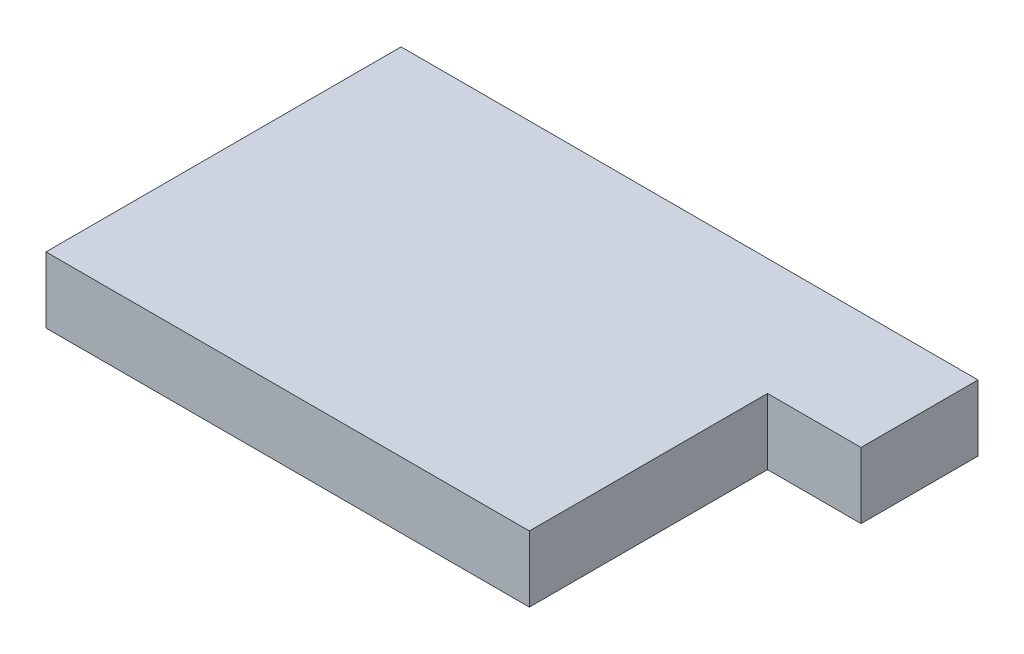
ISO-10303-21;
HEADER;
FILE_DESCRIPTION(('STEP AP214'),'2;1');
FILE_NAME('part.step','',(''),(''),'','','');
FILE_SCHEMA(('AUTOMOTIVE_DESIGN { 1 0 10303 214 1 1 1 1 }'));
ENDSEC;
DATA;
#1=APPLICATION_CONTEXT('core data for automotive mechanical design processes');
#2=APPLICATION_PROTOCOL_DEFINITION('international standard','automotive_design',2000,#1);
#3=PRODUCT_CONTEXT('',#1,'mechanical');
#4=PRODUCT('Part','Part','',(#3));
#5=PRODUCT_RELATED_PRODUCT_CATEGORY('part','',(#4));
#6=PRODUCT_DEFINITION_FORMATION('','',#4);
#7=PRODUCT_DEFINITION_CONTEXT('part definition',#1,'design');
#8=PRODUCT_DEFINITION('design','',#6,#7);
#9=PRODUCT_DEFINITION_SHAPE('','',#8);
#10=(LENGTH_UNIT() NAMED_UNIT(*) SI_UNIT(.MILLI.,.METRE.));
#11=(NAMED_UNIT(*) PLANE_ANGLE_UNIT() SI_UNIT($,.RADIAN.));
#12=(NAMED_UNIT(*) SI_UNIT($,.STERADIAN.) SOLID_ANGLE_UNIT());
#13=UNCERTAINTY_MEASURE_WITH_UNIT(LENGTH_MEASURE(1.E-05),#10,'distance_accuracy_value','');
#14=(GEOMETRIC_REPRESENTATION_CONTEXT(3) GLOBAL_UNCERTAINTY_ASSIGNED_CONTEXT((#13)) GLOBAL_UNIT_ASSIGNED_CONTEXT((#10,
#11,#12)) REPRESENTATION_CONTEXT('',''));
#15=CARTESIAN_POINT('',(0.,0.,0.));
#16=DIRECTION('',(0.,0.,1.));
#17=DIRECTION('',(1.,0.,0.));
#18=AXIS2_PLACEMENT_3D('',#15,#16,#17);
#19=CARTESIAN_POINT('',(139.55,38.1,-34.985));
#20=DIRECTION('',(-1.,0.,0.));
#21=DIRECTION('',(0.,0.,1.));
#22=AXIS2_PLACEMENT_3D('',#19,#20,#21);
#23=PLANE('',#22);
#24=DIRECTION('',(0.,0.,-1.));
#25=VECTOR('',#24,1.);
#26=CARTESIAN_POINT('',(139.55,0.,-34.985));
#27=LINE('',#26,#25);
#28=CARTESIAN_POINT('',(139.55,0.,102.515));
#29=VERTEX_POINT('',#28);
#30=CARTESIAN_POINT('',(139.55,0.,-34.985));
#31=VERTEX_POINT('',#30);
#32=EDGE_CURVE('E116',#29,#31,#27,.T.);
#33=ORIENTED_EDGE('',*,*,#32,.T.);
#34=DIRECTION('',(0.,-1.,0.));
#35=VECTOR('',#34,1.);
#36=CARTESIAN_POINT('',(139.55,38.1,-34.985));
#37=LINE('',#36,#35);
#38=CARTESIAN_POINT('',(139.55,38.1,-34.985));
#39=VERTEX_POINT('',#38);
#40=EDGE_CURVE('E11',#39,#31,#37,.T.);
#41=ORIENTED_EDGE('',*,*,#40,.F.);
#42=DIRECTION('',(0.,0.,-1.));
#43=VECTOR('',#42,1.);
#44=CARTESIAN_POINT('',(139.55,38.1,-34.985));
#45=LINE('',#44,#43);
#46=CARTESIAN_POINT('',(139.55,38.1,102.515));
#47=VERTEX_POINT('',#46);
#48=EDGE_CURVE('E127',#47,#39,#45,.T.);
#49=ORIENTED_EDGE('',*,*,#48,.F.);
#50=DIRECTION('',(0.,-1.,0.));
#51=VECTOR('',#50,1.);
#52=CARTESIAN_POINT('',(139.55,38.1,102.515));
#53=LINE('',#52,#51);
#54=EDGE_CURVE('E112',#47,#29,#53,.T.);
#55=ORIENTED_EDGE('',*,*,#54,.T.);
#56=EDGE_LOOP('',(#33,#41,#49,#55));
#57=FACE_BOUND('',#56,.T.);
#58=ADVANCED_FACE('F33',(#57),#23,.F.);
#59=CARTESIAN_POINT('',(139.55,38.1,-34.985));
#60=DIRECTION('',(0.,0.,-1.));
#61=DIRECTION('',(-1.,0.,0.));
#62=AXIS2_PLACEMENT_3D('',#59,#60,#61);
#63=PLANE('',#62);
#64=DIRECTION('',(1.,0.,0.));
#65=VECTOR('',#64,1.);
#66=CARTESIAN_POINT('',(139.55,0.,-34.985));
#67=LINE('',#66,#65);
#68=CARTESIAN_POINT('',(193.55,0.,-34.985));
#69=VERTEX_POINT('',#68);
#70=EDGE_CURVE('E119',#31,#69,#67,.T.);
#71=ORIENTED_EDGE('',*,*,#70,.T.);
#72=DIRECTION('',(0.,-1.,0.));
#73=VECTOR('',#72,1.);
#74=CARTESIAN_POINT('',(193.55,38.1,-34.985));
#75=LINE('',#74,#73);
#76=CARTESIAN_POINT('',(193.55,38.1,-34.985));
#77=VERTEX_POINT('',#76);
#78=EDGE_CURVE('E41',#77,#69,#75,.T.);
#79=ORIENTED_EDGE('',*,*,#78,.F.);
#80=DIRECTION('',(1.,0.,0.));
#81=VECTOR('',#80,1.);
#82=CARTESIAN_POINT('',(139.55,38.1,-34.985));
#83=LINE('',#82,#81);
#84=EDGE_CURVE('E86',#39,#77,#83,.T.);
#85=ORIENTED_EDGE('',*,*,#84,.F.);
#86=ORIENTED_EDGE('',*,*,#40,.T.);
#87=EDGE_LOOP('',(#71,#79,#85,#86));
#88=FACE_BOUND('',#87,.T.);
#89=ADVANCED_FACE('F151',(#88),#63,.F.);
#90=CARTESIAN_POINT('',(193.55,38.1,-102.515));
#91=DIRECTION('',(-1.,0.,0.));
#92=DIRECTION('',(0.,0.,1.));
#93=AXIS2_PLACEMENT_3D('',#90,#91,#92);
#94=PLANE('',#93);
#95=DIRECTION('',(0.,0.,-1.));
#96=VECTOR('',#95,1.);
#97=CARTESIAN_POINT('',(193.55,0.,-102.515));
#98=LINE('',#97,#96);
#99=CARTESIAN_POINT('',(193.55,0.,-102.515));
#100=VERTEX_POINT('',#99);
#101=EDGE_CURVE('E121',#69,#100,#98,.T.);
#102=ORIENTED_EDGE('',*,*,#101,.T.);
#103=DIRECTION('',(0.,-1.,0.));
#104=VECTOR('',#103,1.);
#105=CARTESIAN_POINT('',(193.55,38.1,-102.515));
#106=LINE('',#105,#104);
#107=CARTESIAN_POINT('',(193.55,38.1,-102.515));
#108=VERTEX_POINT('',#107);
#109=EDGE_CURVE('E107',#108,#100,#106,.T.);
#110=ORIENTED_EDGE('',*,*,#109,.F.);
#111=DIRECTION('',(0.,0.,-1.));
#112=VECTOR('',#111,1.);
#113=CARTESIAN_POINT('',(193.55,38.1,-102.515));
#114=LINE('',#113,#112);
#115=EDGE_CURVE('E99',#77,#108,#114,.T.);
#116=ORIENTED_EDGE('',*,*,#115,.F.);
#117=ORIENTED_EDGE('',*,*,#78,.T.);
#118=EDGE_LOOP('',(#102,#110,#116,#117));
#119=FACE_BOUND('',#118,.T.);
#120=ADVANCED_FACE('F133',(#119),#94,.F.);
#121=CARTESIAN_POINT('',(-139.55,38.1,-102.515));
#122=DIRECTION('',(0.,0.,1.));
#123=DIRECTION('',(1.,0.,0.));
#124=AXIS2_PLACEMENT_3D('',#121,#122,#123);
#125=PLANE('',#124);
#126=DIRECTION('',(-1.,0.,0.));
#127=VECTOR('',#126,1.);
#128=CARTESIAN_POINT('',(-139.55,0.,-102.515));
#129=LINE('',#128,#127);
#130=CARTESIAN_POINT('',(-139.55,0.,-102.515));
#131=VERTEX_POINT('',#130);
#132=EDGE_CURVE('E106',#100,#131,#129,.T.);
#133=ORIENTED_EDGE('',*,*,#132,.T.);
#134=DIRECTION('',(0.,-1.,0.));
#135=VECTOR('',#134,1.);
#136=CARTESIAN_POINT('',(-139.55,38.1,-102.515));
#137=LINE('',#136,#135);
#138=CARTESIAN_POINT('',(-139.55,38.1,-102.515));
#139=VERTEX_POINT('',#138);
#140=EDGE_CURVE('E104',#139,#131,#137,.T.);
#141=ORIENTED_EDGE('',*,*,#140,.F.);
#142=DIRECTION('',(-1.,0.,0.));
#143=VECTOR('',#142,1.);
#144=CARTESIAN_POINT('',(139.55,38.1,-102.515));
#145=LINE('',#144,#143);
#146=EDGE_CURVE('E93',#108,#139,#145,.T.);
#147=ORIENTED_EDGE('',*,*,#146,.F.);
#148=ORIENTED_EDGE('',*,*,#109,.T.);
#149=EDGE_LOOP('',(#133,#141,#147,#148));
#150=FACE_BOUND('',#149,.T.);
#151=ADVANCED_FACE('F105',(#150),#125,.F.);
#152=CARTESIAN_POINT('',(-139.55,38.1,-102.515));
#153=DIRECTION('',(1.,0.,0.));
#154=DIRECTION('',(0.,0.,-1.));
#155=AXIS2_PLACEMENT_3D('',#152,#153,#154);
#156=PLANE('',#155);
#157=DIRECTION('',(0.,0.,1.));
#158=VECTOR('',#157,1.);
#159=CARTESIAN_POINT('',(-139.55,0.,-102.515));
#160=LINE('',#159,#158);
#161=CARTESIAN_POINT('',(-139.55,0.,102.515));
#162=VERTEX_POINT('',#161);
#163=EDGE_CURVE('E72',#131,#162,#160,.T.);
#164=ORIENTED_EDGE('',*,*,#163,.T.);
#165=DIRECTION('',(0.,-1.,0.));
#166=VECTOR('',#165,1.);
#167=CARTESIAN_POINT('',(-139.55,38.1,102.515));
#168=LINE('',#167,#166);
#169=CARTESIAN_POINT('',(-139.55,38.1,102.515));
#170=VERTEX_POINT('',#169);
#171=EDGE_CURVE('E108',#170,#162,#168,.T.);
#172=ORIENTED_EDGE('',*,*,#171,.F.);
#173=DIRECTION('',(0.,0.,1.));
#174=VECTOR('',#173,1.);
#175=CARTESIAN_POINT('',(-139.55,38.1,-102.515));
#176=LINE('',#175,#174);
#177=EDGE_CURVE('E97',#139,#170,#176,.T.);
#178=ORIENTED_EDGE('',*,*,#177,.F.);
#179=ORIENTED_EDGE('',*,*,#140,.T.);
#180=EDGE_LOOP('',(#164,#172,#178,#179));
#181=FACE_BOUND('',#180,.T.);
#182=ADVANCED_FACE('F110',(#181),#156,.F.);
#183=CARTESIAN_POINT('',(-139.55,38.1,102.515));
#184=DIRECTION('',(0.,0.,-1.));
#185=DIRECTION('',(-1.,0.,0.));
#186=AXIS2_PLACEMENT_3D('',#183,#184,#185);
#187=PLANE('',#186);
#188=DIRECTION('',(1.,0.,0.));
#189=VECTOR('',#188,1.);
#190=CARTESIAN_POINT('',(-139.55,0.,102.515));
#191=LINE('',#190,#189);
#192=EDGE_CURVE('E78',#162,#29,#191,.T.);
#193=ORIENTED_EDGE('',*,*,#192,.T.);
#194=ORIENTED_EDGE('',*,*,#54,.F.);
#195=DIRECTION('',(1.,0.,0.));
#196=VECTOR('',#195,1.);
#197=CARTESIAN_POINT('',(-139.55,38.1,102.515));
#198=LINE('',#197,#196);
#199=EDGE_CURVE('E49',#170,#47,#198,.T.);
#200=ORIENTED_EDGE('',*,*,#199,.F.);
#201=ORIENTED_EDGE('',*,*,#171,.T.);
#202=EDGE_LOOP('',(#193,#194,#200,#201));
#203=FACE_BOUND('',#202,.T.);
#204=ADVANCED_FACE('F140',(#203),#187,.F.);
#205=CARTESIAN_POINT('',(0.,38.1,0.));
#206=DIRECTION('',(0.,1.,0.));
#207=DIRECTION('',(0.,0.,1.));
#208=AXIS2_PLACEMENT_3D('',#205,#206,#207);
#209=PLANE('',#208);
#210=ORIENTED_EDGE('',*,*,#48,.T.);
#211=ORIENTED_EDGE('',*,*,#84,.T.);
#212=ORIENTED_EDGE('',*,*,#115,.T.);
#213=ORIENTED_EDGE('',*,*,#146,.T.);
#214=ORIENTED_EDGE('',*,*,#177,.T.);
#215=ORIENTED_EDGE('',*,*,#199,.T.);
#216=EDGE_LOOP('',(#210,#211,#212,#213,#214,#215));
#217=FACE_BOUND('',#216,.T.);
#218=ADVANCED_FACE('F95',(#217),#209,.T.);
#219=CARTESIAN_POINT('',(0.,0.,0.));
#220=DIRECTION('',(0.,1.,0.));
#221=DIRECTION('',(0.,0.,1.));
#222=AXIS2_PLACEMENT_3D('',#219,#220,#221);
#223=PLANE('',#222);
#224=ORIENTED_EDGE('',*,*,#32,.F.);
#225=ORIENTED_EDGE('',*,*,#192,.F.);
#226=ORIENTED_EDGE('',*,*,#163,.F.);
#227=ORIENTED_EDGE('',*,*,#132,.F.);
#228=ORIENTED_EDGE('',*,*,#101,.F.);
#229=ORIENTED_EDGE('',*,*,#70,.F.);
#230=EDGE_LOOP('',(#224,#225,#226,#227,#228,#229));
#231=FACE_BOUND('',#230,.T.);
#232=ADVANCED_FACE('F136',(#231),#223,.F.);
#233=CLOSED_SHELL('',(#58,#89,#120,#151,#182,#204,#218,#232));
#234=MANIFOLD_SOLID_BREP('B2',#233);
#235=ADVANCED_BREP_SHAPE_REPRESENTATION('',(#18,#234),#14);
#236=SHAPE_DEFINITION_REPRESENTATION(#9,#235);
ENDSEC;
END-ISO-10303-21;
